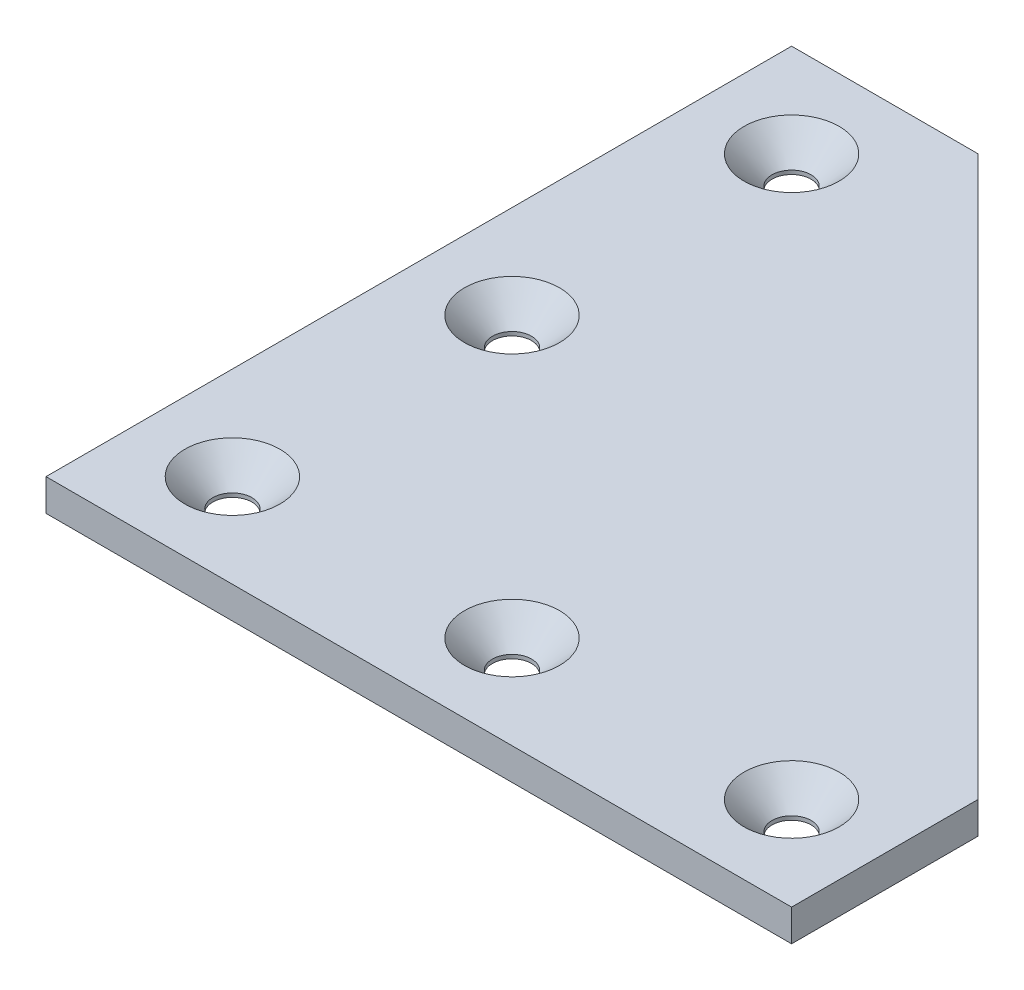
ISO-10303-21;
HEADER;
FILE_DESCRIPTION(('STEP AP214'),'2;1');
FILE_NAME('part.step','',(''),(''),'','','');
FILE_SCHEMA(('AUTOMOTIVE_DESIGN { 1 0 10303 214 1 1 1 1 }'));
ENDSEC;
DATA;
#1=APPLICATION_CONTEXT('core data for automotive mechanical design processes');
#2=APPLICATION_PROTOCOL_DEFINITION('international standard','automotive_design',2000,#1);
#3=PRODUCT_CONTEXT('',#1,'mechanical');
#4=PRODUCT('Part','Part','',(#3));
#5=PRODUCT_RELATED_PRODUCT_CATEGORY('part','',(#4));
#6=PRODUCT_DEFINITION_FORMATION('','',#4);
#7=PRODUCT_DEFINITION_CONTEXT('part definition',#1,'design');
#8=PRODUCT_DEFINITION('design','',#6,#7);
#9=PRODUCT_DEFINITION_SHAPE('','',#8);
#10=(LENGTH_UNIT() NAMED_UNIT(*) SI_UNIT(.MILLI.,.METRE.));
#11=(NAMED_UNIT(*) PLANE_ANGLE_UNIT() SI_UNIT($,.RADIAN.));
#12=(NAMED_UNIT(*) SI_UNIT($,.STERADIAN.) SOLID_ANGLE_UNIT());
#13=UNCERTAINTY_MEASURE_WITH_UNIT(LENGTH_MEASURE(1.E-05),#10,'distance_accuracy_value','');
#14=(GEOMETRIC_REPRESENTATION_CONTEXT(3) GLOBAL_UNCERTAINTY_ASSIGNED_CONTEXT((#13)) GLOBAL_UNIT_ASSIGNED_CONTEXT((#10,
#11,#12)) REPRESENTATION_CONTEXT('',''));
#15=CARTESIAN_POINT('',(0.,0.,0.));
#16=DIRECTION('',(0.,0.,1.));
#17=DIRECTION('',(1.,0.,0.));
#18=AXIS2_PLACEMENT_3D('',#15,#16,#17);
#19=CARTESIAN_POINT('',(80.,3.416,0.));
#20=DIRECTION('',(0.,0.,-1.));
#21=DIRECTION('',(-1.,0.,0.));
#22=AXIS2_PLACEMENT_3D('',#19,#20,#21);
#23=PLANE('',#22);
#24=DIRECTION('',(1.,0.,0.));
#25=VECTOR('',#24,1.);
#26=CARTESIAN_POINT('',(80.,0.,0.));
#27=LINE('',#26,#25);
#28=CARTESIAN_POINT('',(0.,0.,0.));
#29=VERTEX_POINT('',#28);
#30=CARTESIAN_POINT('',(80.,0.,0.));
#31=VERTEX_POINT('',#30);
#32=EDGE_CURVE('E128',#29,#31,#27,.T.);
#33=ORIENTED_EDGE('',*,*,#32,.T.);
#34=DIRECTION('',(0.,-1.,0.));
#35=VECTOR('',#34,1.);
#36=CARTESIAN_POINT('',(80.,3.416,0.));
#37=LINE('',#36,#35);
#38=CARTESIAN_POINT('',(80.,3.416,0.));
#39=VERTEX_POINT('',#38);
#40=EDGE_CURVE('E149',#39,#31,#37,.T.);
#41=ORIENTED_EDGE('',*,*,#40,.F.);
#42=DIRECTION('',(1.,0.,0.));
#43=VECTOR('',#42,1.);
#44=CARTESIAN_POINT('',(80.,3.416,0.));
#45=LINE('',#44,#43);
#46=CARTESIAN_POINT('',(0.,3.416,0.));
#47=VERTEX_POINT('',#46);
#48=EDGE_CURVE('E142',#47,#39,#45,.T.);
#49=ORIENTED_EDGE('',*,*,#48,.F.);
#50=DIRECTION('',(0.,-1.,0.));
#51=VECTOR('',#50,1.);
#52=CARTESIAN_POINT('',(0.,3.416,0.));
#53=LINE('',#52,#51);
#54=EDGE_CURVE('E124',#47,#29,#53,.T.);
#55=ORIENTED_EDGE('',*,*,#54,.T.);
#56=EDGE_LOOP('',(#33,#41,#49,#55));
#57=FACE_BOUND('',#56,.T.);
#58=ADVANCED_FACE('F45',(#57),#23,.F.);
#59=CARTESIAN_POINT('',(80.,3.416,-20.));
#60=DIRECTION('',(-1.,0.,0.));
#61=DIRECTION('',(0.,0.,1.));
#62=AXIS2_PLACEMENT_3D('',#59,#60,#61);
#63=PLANE('',#62);
#64=DIRECTION('',(0.,0.,-1.));
#65=VECTOR('',#64,1.);
#66=CARTESIAN_POINT('',(80.,0.,-20.));
#67=LINE('',#66,#65);
#68=CARTESIAN_POINT('',(80.,0.,-20.));
#69=VERTEX_POINT('',#68);
#70=EDGE_CURVE('E132',#31,#69,#67,.T.);
#71=ORIENTED_EDGE('',*,*,#70,.T.);
#72=DIRECTION('',(0.,-1.,0.));
#73=VECTOR('',#72,1.);
#74=CARTESIAN_POINT('',(80.,3.416,-20.));
#75=LINE('',#74,#73);
#76=CARTESIAN_POINT('',(80.,3.416,-20.));
#77=VERTEX_POINT('',#76);
#78=EDGE_CURVE('E117',#77,#69,#75,.T.);
#79=ORIENTED_EDGE('',*,*,#78,.F.);
#80=DIRECTION('',(0.,0.,-1.));
#81=VECTOR('',#80,1.);
#82=CARTESIAN_POINT('',(80.,3.416,-20.));
#83=LINE('',#82,#81);
#84=EDGE_CURVE('E99',#39,#77,#83,.T.);
#85=ORIENTED_EDGE('',*,*,#84,.F.);
#86=ORIENTED_EDGE('',*,*,#40,.T.);
#87=EDGE_LOOP('',(#71,#79,#85,#86));
#88=FACE_BOUND('',#87,.T.);
#89=ADVANCED_FACE('F224',(#88),#63,.F.);
#90=CARTESIAN_POINT('',(20.,3.416,-79.9999999999998));
#91=DIRECTION('',(-0.707106781186546,0.,0.707106781186549));
#92=DIRECTION('',(0.707106781186549,0.,0.707106781186546));
#93=AXIS2_PLACEMENT_3D('',#90,#91,#92);
#94=PLANE('',#93);
#95=DIRECTION('',(-0.707106781186549,0.,-0.707106781186546));
#96=VECTOR('',#95,1.);
#97=CARTESIAN_POINT('',(20.,0.,-79.9999999999998));
#98=LINE('',#97,#96);
#99=CARTESIAN_POINT('',(20.,0.,-79.9999999999998));
#100=VERTEX_POINT('',#99);
#101=EDGE_CURVE('E115',#69,#100,#98,.T.);
#102=ORIENTED_EDGE('',*,*,#101,.T.);
#103=DIRECTION('',(0.,-1.,0.));
#104=VECTOR('',#103,1.);
#105=CARTESIAN_POINT('',(20.,3.416,-79.9999999999998));
#106=LINE('',#105,#104);
#107=CARTESIAN_POINT('',(20.,3.416,-79.9999999999998));
#108=VERTEX_POINT('',#107);
#109=EDGE_CURVE('E112',#108,#100,#106,.T.);
#110=ORIENTED_EDGE('',*,*,#109,.F.);
#111=DIRECTION('',(-0.707106781186549,0.,-0.707106781186546));
#112=VECTOR('',#111,1.);
#113=CARTESIAN_POINT('',(20.,3.416,-79.9999999999998));
#114=LINE('',#113,#112);
#115=EDGE_CURVE('E103',#77,#108,#114,.T.);
#116=ORIENTED_EDGE('',*,*,#115,.F.);
#117=ORIENTED_EDGE('',*,*,#78,.T.);
#118=EDGE_LOOP('',(#102,#110,#116,#117));
#119=FACE_BOUND('',#118,.T.);
#120=ADVANCED_FACE('F113',(#119),#94,.F.);
#121=CARTESIAN_POINT('',(0.,3.416,-79.9999999999998));
#122=DIRECTION('',(0.,0.,1.));
#123=DIRECTION('',(1.,0.,0.));
#124=AXIS2_PLACEMENT_3D('',#121,#122,#123);
#125=PLANE('',#124);
#126=DIRECTION('',(-1.,0.,0.));
#127=VECTOR('',#126,1.);
#128=CARTESIAN_POINT('',(0.,0.,-79.9999999999998));
#129=LINE('',#128,#127);
#130=CARTESIAN_POINT('',(0.,0.,-79.9999999999998));
#131=VERTEX_POINT('',#130);
#132=EDGE_CURVE('E84',#100,#131,#129,.T.);
#133=ORIENTED_EDGE('',*,*,#132,.T.);
#134=DIRECTION('',(0.,-1.,0.));
#135=VECTOR('',#134,1.);
#136=CARTESIAN_POINT('',(0.,3.416,-79.9999999999998));
#137=LINE('',#136,#135);
#138=CARTESIAN_POINT('',(0.,3.416,-79.9999999999998));
#139=VERTEX_POINT('',#138);
#140=EDGE_CURVE('E118',#139,#131,#137,.T.);
#141=ORIENTED_EDGE('',*,*,#140,.F.);
#142=DIRECTION('',(-1.,0.,0.));
#143=VECTOR('',#142,1.);
#144=CARTESIAN_POINT('',(0.,3.416,-79.9999999999998));
#145=LINE('',#144,#143);
#146=EDGE_CURVE('E107',#108,#139,#145,.T.);
#147=ORIENTED_EDGE('',*,*,#146,.F.);
#148=ORIENTED_EDGE('',*,*,#109,.T.);
#149=EDGE_LOOP('',(#133,#141,#147,#148));
#150=FACE_BOUND('',#149,.T.);
#151=ADVANCED_FACE('F120',(#150),#125,.F.);
#152=CARTESIAN_POINT('',(0.,3.416,0.));
#153=DIRECTION('',(1.,0.,0.));
#154=DIRECTION('',(0.,0.,-1.));
#155=AXIS2_PLACEMENT_3D('',#152,#153,#154);
#156=PLANE('',#155);
#157=DIRECTION('',(0.,0.,1.));
#158=VECTOR('',#157,1.);
#159=CARTESIAN_POINT('',(0.,0.,0.));
#160=LINE('',#159,#158);
#161=EDGE_CURVE('E90',#131,#29,#160,.T.);
#162=ORIENTED_EDGE('',*,*,#161,.T.);
#163=ORIENTED_EDGE('',*,*,#54,.F.);
#164=DIRECTION('',(0.,0.,1.));
#165=VECTOR('',#164,1.);
#166=CARTESIAN_POINT('',(0.,3.416,0.));
#167=LINE('',#166,#165);
#168=EDGE_CURVE('E64',#139,#47,#167,.T.);
#169=ORIENTED_EDGE('',*,*,#168,.F.);
#170=ORIENTED_EDGE('',*,*,#140,.T.);
#171=EDGE_LOOP('',(#162,#163,#169,#170));
#172=FACE_BOUND('',#171,.T.);
#173=ADVANCED_FACE('F274',(#172),#156,.F.);
#174=CARTESIAN_POINT('',(0.,3.416,0.));
#175=DIRECTION('',(0.,-1.,0.));
#176=DIRECTION('',(0.,0.,-1.));
#177=AXIS2_PLACEMENT_3D('',#174,#175,#176);
#178=PLANE('',#177);
#179=CARTESIAN_POINT('',(70.,3.416,-10.));
#180=DIRECTION('',(0.,-1.,0.));
#181=DIRECTION('',(0.,0.,-1.));
#182=AXIS2_PLACEMENT_3D('',#179,#180,#181);
#183=CIRCLE('',#182,5.10000000000001);
#184=CARTESIAN_POINT('',(70.,3.416,-15.1));
#185=VERTEX_POINT('',#184);
#186=EDGE_CURVE('E191',#185,#185,#183,.T.);
#187=ORIENTED_EDGE('',*,*,#186,.T.);
#188=EDGE_LOOP('',(#187));
#189=FACE_BOUND('',#188,.T.);
#190=CARTESIAN_POINT('',(40.,3.416,-10.));
#191=DIRECTION('',(0.,-1.,0.));
#192=DIRECTION('',(0.,0.,-1.));
#193=AXIS2_PLACEMENT_3D('',#190,#191,#192);
#194=CIRCLE('',#193,5.10000000000001);
#195=CARTESIAN_POINT('',(40.,3.416,-15.1));
#196=VERTEX_POINT('',#195);
#197=EDGE_CURVE('E187',#196,#196,#194,.T.);
#198=ORIENTED_EDGE('',*,*,#197,.T.);
#199=EDGE_LOOP('',(#198));
#200=FACE_BOUND('',#199,.T.);
#201=CARTESIAN_POINT('',(10.,3.416,-10.));
#202=DIRECTION('',(0.,-1.,0.));
#203=DIRECTION('',(0.,0.,-1.));
#204=AXIS2_PLACEMENT_3D('',#201,#202,#203);
#205=CIRCLE('',#204,5.10000000000002);
#206=CARTESIAN_POINT('',(10.,3.416,-15.1));
#207=VERTEX_POINT('',#206);
#208=EDGE_CURVE('E183',#207,#207,#205,.T.);
#209=ORIENTED_EDGE('',*,*,#208,.T.);
#210=EDGE_LOOP('',(#209));
#211=FACE_BOUND('',#210,.T.);
#212=CARTESIAN_POINT('',(9.9999999999999,3.416,-40.));
#213=DIRECTION('',(0.,-1.,0.));
#214=DIRECTION('',(0.,0.,-1.));
#215=AXIS2_PLACEMENT_3D('',#212,#213,#214);
#216=CIRCLE('',#215,5.10000000000001);
#217=CARTESIAN_POINT('',(9.9999999999999,3.416,-45.1));
#218=VERTEX_POINT('',#217);
#219=EDGE_CURVE('E179',#218,#218,#216,.T.);
#220=ORIENTED_EDGE('',*,*,#219,.T.);
#221=EDGE_LOOP('',(#220));
#222=FACE_BOUND('',#221,.T.);
#223=CARTESIAN_POINT('',(9.99999999999979,3.416,-70.));
#224=DIRECTION('',(0.,-1.,0.));
#225=DIRECTION('',(0.,0.,-1.));
#226=AXIS2_PLACEMENT_3D('',#223,#224,#225);
#227=CIRCLE('',#226,5.10000000000001);
#228=CARTESIAN_POINT('',(9.99999999999979,3.416,-75.1));
#229=VERTEX_POINT('',#228);
#230=EDGE_CURVE('E175',#229,#229,#227,.T.);
#231=ORIENTED_EDGE('',*,*,#230,.T.);
#232=EDGE_LOOP('',(#231));
#233=FACE_BOUND('',#232,.T.);
#234=ORIENTED_EDGE('',*,*,#48,.T.);
#235=ORIENTED_EDGE('',*,*,#84,.T.);
#236=ORIENTED_EDGE('',*,*,#115,.T.);
#237=ORIENTED_EDGE('',*,*,#146,.T.);
#238=ORIENTED_EDGE('',*,*,#168,.T.);
#239=EDGE_LOOP('',(#234,#235,#236,#237,#238));
#240=FACE_BOUND('',#239,.T.);
#241=ADVANCED_FACE('F105',(#189,#200,#211,#222,#233,#240),#178,.F.);
#242=CARTESIAN_POINT('',(0.,0.,0.));
#243=DIRECTION('',(0.,-1.,0.));
#244=DIRECTION('',(0.,0.,-1.));
#245=AXIS2_PLACEMENT_3D('',#242,#243,#244);
#246=PLANE('',#245);
#247=CARTESIAN_POINT('',(9.99999999999979,0.,-70.));
#248=DIRECTION('',(0.,-1.,0.));
#249=DIRECTION('',(0.,0.,-1.));
#250=AXIS2_PLACEMENT_3D('',#247,#248,#249);
#251=CIRCLE('',#250,2.1);
#252=CARTESIAN_POINT('',(9.99999999999979,0.,-72.1));
#253=VERTEX_POINT('',#252);
#254=EDGE_CURVE('E133',#253,#253,#251,.T.);
#255=ORIENTED_EDGE('',*,*,#254,.F.);
#256=EDGE_LOOP('',(#255));
#257=FACE_BOUND('',#256,.T.);
#258=CARTESIAN_POINT('',(9.9999999999999,0.,-40.));
#259=DIRECTION('',(0.,-1.,0.));
#260=DIRECTION('',(0.,0.,-1.));
#261=AXIS2_PLACEMENT_3D('',#258,#259,#260);
#262=CIRCLE('',#261,2.1);
#263=CARTESIAN_POINT('',(9.9999999999999,0.,-42.1));
#264=VERTEX_POINT('',#263);
#265=EDGE_CURVE('E165',#264,#264,#262,.T.);
#266=ORIENTED_EDGE('',*,*,#265,.F.);
#267=EDGE_LOOP('',(#266));
#268=FACE_BOUND('',#267,.T.);
#269=CARTESIAN_POINT('',(70.,0.,-10.));
#270=DIRECTION('',(0.,-1.,0.));
#271=DIRECTION('',(0.,0.,-1.));
#272=AXIS2_PLACEMENT_3D('',#269,#270,#271);
#273=CIRCLE('',#272,2.1);
#274=CARTESIAN_POINT('',(70.,0.,-12.1));
#275=VERTEX_POINT('',#274);
#276=EDGE_CURVE('E161',#275,#275,#273,.T.);
#277=ORIENTED_EDGE('',*,*,#276,.F.);
#278=EDGE_LOOP('',(#277));
#279=FACE_BOUND('',#278,.T.);
#280=CARTESIAN_POINT('',(10.,0.,-10.));
#281=DIRECTION('',(0.,-1.,0.));
#282=DIRECTION('',(0.,0.,-1.));
#283=AXIS2_PLACEMENT_3D('',#280,#281,#282);
#284=CIRCLE('',#283,2.1);
#285=CARTESIAN_POINT('',(10.,0.,-12.1));
#286=VERTEX_POINT('',#285);
#287=EDGE_CURVE('E157',#286,#286,#284,.T.);
#288=ORIENTED_EDGE('',*,*,#287,.F.);
#289=EDGE_LOOP('',(#288));
#290=FACE_BOUND('',#289,.T.);
#291=CARTESIAN_POINT('',(40.,0.,-10.));
#292=DIRECTION('',(0.,-1.,0.));
#293=DIRECTION('',(0.,0.,-1.));
#294=AXIS2_PLACEMENT_3D('',#291,#292,#293);
#295=CIRCLE('',#294,2.1);
#296=CARTESIAN_POINT('',(40.,0.,-12.1));
#297=VERTEX_POINT('',#296);
#298=EDGE_CURVE('E153',#297,#297,#295,.T.);
#299=ORIENTED_EDGE('',*,*,#298,.F.);
#300=EDGE_LOOP('',(#299));
#301=FACE_BOUND('',#300,.T.);
#302=ORIENTED_EDGE('',*,*,#32,.F.);
#303=ORIENTED_EDGE('',*,*,#161,.F.);
#304=ORIENTED_EDGE('',*,*,#132,.F.);
#305=ORIENTED_EDGE('',*,*,#101,.F.);
#306=ORIENTED_EDGE('',*,*,#70,.F.);
#307=EDGE_LOOP('',(#302,#303,#304,#305,#306));
#308=FACE_BOUND('',#307,.T.);
#309=ADVANCED_FACE('F263',(#257,#268,#279,#290,#301,#308),#246,.T.);
#310=CARTESIAN_POINT('',(40.,-0.584,-10.));
#311=DIRECTION('',(0.,1.,0.));
#312=DIRECTION('',(0.,0.,1.));
#313=AXIS2_PLACEMENT_3D('',#310,#311,#312);
#314=CYLINDRICAL_SURFACE('',#313,2.1);
#315=CARTESIAN_POINT('',(40.,0.415999999999996,-10.));
#316=DIRECTION('',(0.,-1.,0.));
#317=DIRECTION('',(0.,0.,-1.));
#318=AXIS2_PLACEMENT_3D('',#315,#316,#317);
#319=CIRCLE('',#318,2.1);
#320=CARTESIAN_POINT('',(40.,0.415999999999996,-12.1));
#321=VERTEX_POINT('',#320);
#322=EDGE_CURVE('E195',#321,#321,#319,.F.);
#323=ORIENTED_EDGE('',*,*,#322,.T.);
#324=EDGE_LOOP('',(#323));
#325=FACE_BOUND('',#324,.T.);
#326=ORIENTED_EDGE('',*,*,#298,.T.);
#327=EDGE_LOOP('',(#326));
#328=FACE_BOUND('',#327,.T.);
#329=ADVANCED_FACE('F259',(#325,#328),#314,.F.);
#330=CARTESIAN_POINT('',(10.,-0.584,-10.));
#331=DIRECTION('',(0.,1.,0.));
#332=DIRECTION('',(0.,0.,1.));
#333=AXIS2_PLACEMENT_3D('',#330,#331,#332);
#334=CYLINDRICAL_SURFACE('',#333,2.1);
#335=CARTESIAN_POINT('',(10.,0.415999999999984,-10.));
#336=DIRECTION('',(0.,-1.,0.));
#337=DIRECTION('',(0.,0.,-1.));
#338=AXIS2_PLACEMENT_3D('',#335,#336,#337);
#339=CIRCLE('',#338,2.1);
#340=CARTESIAN_POINT('',(10.,0.415999999999984,-12.1));
#341=VERTEX_POINT('',#340);
#342=EDGE_CURVE('E199',#341,#341,#339,.F.);
#343=ORIENTED_EDGE('',*,*,#342,.T.);
#344=EDGE_LOOP('',(#343));
#345=FACE_BOUND('',#344,.T.);
#346=ORIENTED_EDGE('',*,*,#287,.T.);
#347=EDGE_LOOP('',(#346));
#348=FACE_BOUND('',#347,.T.);
#349=ADVANCED_FACE('F262',(#345,#348),#334,.F.);
#350=CARTESIAN_POINT('',(70.,-0.584,-10.));
#351=DIRECTION('',(0.,1.,0.));
#352=DIRECTION('',(0.,0.,1.));
#353=AXIS2_PLACEMENT_3D('',#350,#351,#352);
#354=CYLINDRICAL_SURFACE('',#353,2.1);
#355=CARTESIAN_POINT('',(70.,0.416000000000003,-10.));
#356=DIRECTION('',(0.,-1.,0.));
#357=DIRECTION('',(0.,0.,-1.));
#358=AXIS2_PLACEMENT_3D('',#355,#356,#357);
#359=CIRCLE('',#358,2.1);
#360=CARTESIAN_POINT('',(70.,0.416000000000003,-12.1));
#361=VERTEX_POINT('',#360);
#362=EDGE_CURVE('E152',#361,#361,#359,.F.);
#363=ORIENTED_EDGE('',*,*,#362,.T.);
#364=EDGE_LOOP('',(#363));
#365=FACE_BOUND('',#364,.T.);
#366=ORIENTED_EDGE('',*,*,#276,.T.);
#367=EDGE_LOOP('',(#366));
#368=FACE_BOUND('',#367,.T.);
#369=ADVANCED_FACE('F329',(#365,#368),#354,.F.);
#370=CARTESIAN_POINT('',(9.9999999999999,-0.584,-40.));
#371=DIRECTION('',(0.,1.,0.));
#372=DIRECTION('',(0.,0.,1.));
#373=AXIS2_PLACEMENT_3D('',#370,#371,#372);
#374=CYLINDRICAL_SURFACE('',#373,2.1);
#375=CARTESIAN_POINT('',(9.9999999999999,0.415999999999997,-40.));
#376=DIRECTION('',(0.,-1.,0.));
#377=DIRECTION('',(0.,0.,-1.));
#378=AXIS2_PLACEMENT_3D('',#375,#376,#377);
#379=CIRCLE('',#378,2.1);
#380=CARTESIAN_POINT('',(9.9999999999999,0.415999999999997,-42.1));
#381=VERTEX_POINT('',#380);
#382=EDGE_CURVE('E56',#381,#381,#379,.F.);
#383=ORIENTED_EDGE('',*,*,#382,.T.);
#384=EDGE_LOOP('',(#383));
#385=FACE_BOUND('',#384,.T.);
#386=ORIENTED_EDGE('',*,*,#265,.T.);
#387=EDGE_LOOP('',(#386));
#388=FACE_BOUND('',#387,.T.);
#389=ADVANCED_FACE('F206',(#385,#388),#374,.F.);
#390=CARTESIAN_POINT('',(9.99999999999979,-0.584,-70.));
#391=DIRECTION('',(0.,1.,0.));
#392=DIRECTION('',(0.,0.,1.));
#393=AXIS2_PLACEMENT_3D('',#390,#391,#392);
#394=CYLINDRICAL_SURFACE('',#393,2.1);
#395=CARTESIAN_POINT('',(9.99999999999979,0.415999999999999,-70.));
#396=DIRECTION('',(0.,-1.,0.));
#397=DIRECTION('',(0.,0.,-1.));
#398=AXIS2_PLACEMENT_3D('',#395,#396,#397);
#399=CIRCLE('',#398,2.1);
#400=CARTESIAN_POINT('',(9.99999999999979,0.415999999999999,-72.1));
#401=VERTEX_POINT('',#400);
#402=EDGE_CURVE('E11',#401,#401,#399,.F.);
#403=ORIENTED_EDGE('',*,*,#402,.T.);
#404=EDGE_LOOP('',(#403));
#405=FACE_BOUND('',#404,.T.);
#406=ORIENTED_EDGE('',*,*,#254,.T.);
#407=EDGE_LOOP('',(#406));
#408=FACE_BOUND('',#407,.T.);
#409=ADVANCED_FACE('F240',(#405,#408),#394,.F.);
#410=CARTESIAN_POINT('',(70.,0.416000000000003,-10.));
#411=DIRECTION('',(0.,1.,0.));
#412=DIRECTION('',(0.,0.,1.));
#413=AXIS2_PLACEMENT_3D('',#410,#411,#412);
#414=CONICAL_SURFACE('',#413,2.1,0.785398163397449);
#415=ORIENTED_EDGE('',*,*,#186,.F.);
#416=EDGE_LOOP('',(#415));
#417=FACE_BOUND('',#416,.T.);
#418=ORIENTED_EDGE('',*,*,#362,.F.);
#419=EDGE_LOOP('',(#418));
#420=FACE_BOUND('',#419,.T.);
#421=ADVANCED_FACE('F234',(#417,#420),#414,.F.);
#422=CARTESIAN_POINT('',(40.,0.415999999999996,-10.));
#423=DIRECTION('',(0.,1.,0.));
#424=DIRECTION('',(0.,0.,1.));
#425=AXIS2_PLACEMENT_3D('',#422,#423,#424);
#426=CONICAL_SURFACE('',#425,2.1,0.785398163397449);
#427=ORIENTED_EDGE('',*,*,#197,.F.);
#428=EDGE_LOOP('',(#427));
#429=FACE_BOUND('',#428,.T.);
#430=ORIENTED_EDGE('',*,*,#322,.F.);
#431=EDGE_LOOP('',(#430));
#432=FACE_BOUND('',#431,.T.);
#433=ADVANCED_FACE('F218',(#429,#432),#426,.F.);
#434=CARTESIAN_POINT('',(10.,0.415999999999984,-10.));
#435=DIRECTION('',(0.,1.,0.));
#436=DIRECTION('',(0.,0.,1.));
#437=AXIS2_PLACEMENT_3D('',#434,#435,#436);
#438=CONICAL_SURFACE('',#437,2.1,0.78539816339745);
#439=ORIENTED_EDGE('',*,*,#208,.F.);
#440=EDGE_LOOP('',(#439));
#441=FACE_BOUND('',#440,.T.);
#442=ORIENTED_EDGE('',*,*,#342,.F.);
#443=EDGE_LOOP('',(#442));
#444=FACE_BOUND('',#443,.T.);
#445=ADVANCED_FACE('F211',(#441,#444),#438,.F.);
#446=CARTESIAN_POINT('',(9.9999999999999,0.415999999999997,-40.));
#447=DIRECTION('',(0.,1.,0.));
#448=DIRECTION('',(0.,0.,1.));
#449=AXIS2_PLACEMENT_3D('',#446,#447,#448);
#450=CONICAL_SURFACE('',#449,2.1,0.785398163397449);
#451=ORIENTED_EDGE('',*,*,#219,.F.);
#452=EDGE_LOOP('',(#451));
#453=FACE_BOUND('',#452,.T.);
#454=ORIENTED_EDGE('',*,*,#382,.F.);
#455=EDGE_LOOP('',(#454));
#456=FACE_BOUND('',#455,.T.);
#457=ADVANCED_FACE('F209',(#453,#456),#450,.F.);
#458=CARTESIAN_POINT('',(9.99999999999979,0.415999999999999,-70.));
#459=DIRECTION('',(0.,1.,0.));
#460=DIRECTION('',(0.,0.,1.));
#461=AXIS2_PLACEMENT_3D('',#458,#459,#460);
#462=CONICAL_SURFACE('',#461,2.1,0.785398163397449);
#463=ORIENTED_EDGE('',*,*,#230,.F.);
#464=EDGE_LOOP('',(#463));
#465=FACE_BOUND('',#464,.T.);
#466=ORIENTED_EDGE('',*,*,#402,.F.);
#467=EDGE_LOOP('',(#466));
#468=FACE_BOUND('',#467,.T.);
#469=ADVANCED_FACE('F48',(#465,#468),#462,.F.);
#470=CLOSED_SHELL('',(#58,#89,#120,#151,#173,#241,#309,#329,#349,#369,#389,#409,#421,#433,#445,
#457,#469));
#471=MANIFOLD_SOLID_BREP('B2',#470);
#472=ADVANCED_BREP_SHAPE_REPRESENTATION('',(#18,#471),#14);
#473=SHAPE_DEFINITION_REPRESENTATION(#9,#472);
ENDSEC;
END-ISO-10303-21;
